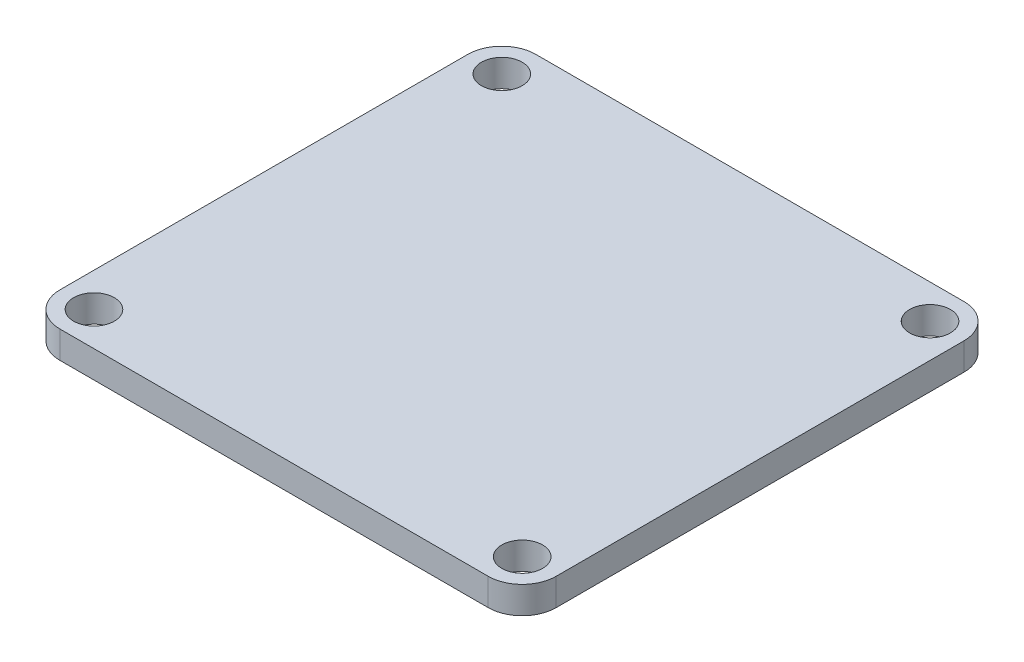
ISO-10303-21;
HEADER;
FILE_DESCRIPTION(('STEP AP214'),'2;1');
FILE_NAME('part.step','',(''),(''),'','','');
FILE_SCHEMA(('AUTOMOTIVE_DESIGN { 1 0 10303 214 1 1 1 1 }'));
ENDSEC;
DATA;
#1=APPLICATION_CONTEXT('core data for automotive mechanical design processes');
#2=APPLICATION_PROTOCOL_DEFINITION('international standard','automotive_design',2000,#1);
#3=PRODUCT_CONTEXT('',#1,'mechanical');
#4=PRODUCT('Part','Part','',(#3));
#5=PRODUCT_RELATED_PRODUCT_CATEGORY('part','',(#4));
#6=PRODUCT_DEFINITION_FORMATION('','',#4);
#7=PRODUCT_DEFINITION_CONTEXT('part definition',#1,'design');
#8=PRODUCT_DEFINITION('design','',#6,#7);
#9=PRODUCT_DEFINITION_SHAPE('','',#8);
#10=(LENGTH_UNIT() NAMED_UNIT(*) SI_UNIT(.MILLI.,.METRE.));
#11=(NAMED_UNIT(*) PLANE_ANGLE_UNIT() SI_UNIT($,.RADIAN.));
#12=(NAMED_UNIT(*) SI_UNIT($,.STERADIAN.) SOLID_ANGLE_UNIT());
#13=UNCERTAINTY_MEASURE_WITH_UNIT(LENGTH_MEASURE(1.E-05),#10,'distance_accuracy_value','');
#14=(GEOMETRIC_REPRESENTATION_CONTEXT(3) GLOBAL_UNCERTAINTY_ASSIGNED_CONTEXT((#13)) GLOBAL_UNIT_ASSIGNED_CONTEXT((#10,
#11,#12)) REPRESENTATION_CONTEXT('',''));
#15=CARTESIAN_POINT('',(0.,0.,0.));
#16=DIRECTION('',(0.,0.,1.));
#17=DIRECTION('',(1.,0.,0.));
#18=AXIS2_PLACEMENT_3D('',#15,#16,#17);
#19=CARTESIAN_POINT('',(-31.5,4.,30.));
#20=DIRECTION('',(0.,-1.,0.));
#21=DIRECTION('',(0.,0.,-1.));
#22=AXIS2_PLACEMENT_3D('',#19,#20,#21);
#23=PLANE('',#22);
#24=CARTESIAN_POINT('',(-31.5,4.,30.));
#25=DIRECTION('',(0.,1.,0.));
#26=DIRECTION('',(0.,0.,-1.));
#27=AXIS2_PLACEMENT_3D('',#24,#25,#26);
#28=CIRCLE('',#27,5.);
#29=CARTESIAN_POINT('',(-36.5,4.,30.));
#30=VERTEX_POINT('',#29);
#31=CARTESIAN_POINT('',(-31.5,4.,35.));
#32=VERTEX_POINT('',#31);
#33=EDGE_CURVE('E147',#30,#32,#28,.T.);
#34=ORIENTED_EDGE('',*,*,#33,.T.);
#35=DIRECTION('',(1.,0.,0.));
#36=VECTOR('',#35,1.);
#37=CARTESIAN_POINT('',(-31.5,4.,35.));
#38=LINE('',#37,#36);
#39=CARTESIAN_POINT('',(31.5,4.,35.));
#40=VERTEX_POINT('',#39);
#41=EDGE_CURVE('E95',#32,#40,#38,.T.);
#42=ORIENTED_EDGE('',*,*,#41,.T.);
#43=CARTESIAN_POINT('',(31.5,4.,30.));
#44=DIRECTION('',(0.,1.,0.));
#45=DIRECTION('',(0.,0.,1.));
#46=AXIS2_PLACEMENT_3D('',#43,#44,#45);
#47=CIRCLE('',#46,5.);
#48=CARTESIAN_POINT('',(36.5,4.,30.));
#49=VERTEX_POINT('',#48);
#50=EDGE_CURVE('E162',#40,#49,#47,.T.);
#51=ORIENTED_EDGE('',*,*,#50,.T.);
#52=DIRECTION('',(0.,0.,-1.));
#53=VECTOR('',#52,1.);
#54=CARTESIAN_POINT('',(36.5,4.,30.));
#55=LINE('',#54,#53);
#56=CARTESIAN_POINT('',(36.5,4.,-30.));
#57=VERTEX_POINT('',#56);
#58=EDGE_CURVE('E175',#49,#57,#55,.T.);
#59=ORIENTED_EDGE('',*,*,#58,.T.);
#60=CARTESIAN_POINT('',(31.5,4.,-30.));
#61=DIRECTION('',(0.,1.,0.));
#62=DIRECTION('',(0.,0.,-1.));
#63=AXIS2_PLACEMENT_3D('',#60,#61,#62);
#64=CIRCLE('',#63,5.);
#65=CARTESIAN_POINT('',(31.5,4.,-35.));
#66=VERTEX_POINT('',#65);
#67=EDGE_CURVE('E114',#57,#66,#64,.T.);
#68=ORIENTED_EDGE('',*,*,#67,.T.);
#69=DIRECTION('',(-1.,0.,0.));
#70=VECTOR('',#69,1.);
#71=CARTESIAN_POINT('',(-31.5,4.,-35.));
#72=LINE('',#71,#70);
#73=CARTESIAN_POINT('',(-31.5,4.,-35.));
#74=VERTEX_POINT('',#73);
#75=EDGE_CURVE('E108',#66,#74,#72,.T.);
#76=ORIENTED_EDGE('',*,*,#75,.T.);
#77=CARTESIAN_POINT('',(-31.5,4.,-30.));
#78=DIRECTION('',(0.,1.,0.));
#79=DIRECTION('',(0.,0.,-1.));
#80=AXIS2_PLACEMENT_3D('',#77,#78,#79);
#81=CIRCLE('',#80,5.);
#82=CARTESIAN_POINT('',(-36.5,4.,-30.));
#83=VERTEX_POINT('',#82);
#84=EDGE_CURVE('E112',#74,#83,#81,.T.);
#85=ORIENTED_EDGE('',*,*,#84,.T.);
#86=DIRECTION('',(0.,0.,1.));
#87=VECTOR('',#86,1.);
#88=CARTESIAN_POINT('',(-36.5,4.,30.));
#89=LINE('',#88,#87);
#90=EDGE_CURVE('E52',#83,#30,#89,.T.);
#91=ORIENTED_EDGE('',*,*,#90,.T.);
#92=EDGE_LOOP('',(#34,#42,#51,#59,#68,#76,#85,#91));
#93=FACE_BOUND('',#92,.T.);
#94=CARTESIAN_POINT('',(-31.5,4.,-30.));
#95=DIRECTION('',(0.,1.,0.));
#96=DIRECTION('',(0.,0.,1.));
#97=AXIS2_PLACEMENT_3D('',#94,#95,#96);
#98=CIRCLE('',#97,3.00000000000001);
#99=CARTESIAN_POINT('',(-31.5,4.,-27.));
#100=VERTEX_POINT('',#99);
#101=EDGE_CURVE('E136',#100,#100,#98,.T.);
#102=ORIENTED_EDGE('',*,*,#101,.F.);
#103=EDGE_LOOP('',(#102));
#104=FACE_BOUND('',#103,.T.);
#105=CARTESIAN_POINT('',(-31.5,4.,30.));
#106=DIRECTION('',(0.,1.,0.));
#107=DIRECTION('',(0.,0.,1.));
#108=AXIS2_PLACEMENT_3D('',#105,#106,#107);
#109=CIRCLE('',#108,3.00000000000001);
#110=CARTESIAN_POINT('',(-31.5,4.,33.));
#111=VERTEX_POINT('',#110);
#112=EDGE_CURVE('E184',#111,#111,#109,.T.);
#113=ORIENTED_EDGE('',*,*,#112,.F.);
#114=EDGE_LOOP('',(#113));
#115=FACE_BOUND('',#114,.T.);
#116=CARTESIAN_POINT('',(31.5,4.,-30.));
#117=DIRECTION('',(0.,1.,0.));
#118=DIRECTION('',(0.,0.,1.));
#119=AXIS2_PLACEMENT_3D('',#116,#117,#118);
#120=CIRCLE('',#119,3.00000000000001);
#121=CARTESIAN_POINT('',(31.5,4.,-27.));
#122=VERTEX_POINT('',#121);
#123=EDGE_CURVE('E190',#122,#122,#120,.T.);
#124=ORIENTED_EDGE('',*,*,#123,.F.);
#125=EDGE_LOOP('',(#124));
#126=FACE_BOUND('',#125,.T.);
#127=CARTESIAN_POINT('',(31.5,4.,30.));
#128=DIRECTION('',(0.,1.,0.));
#129=DIRECTION('',(0.,0.,1.));
#130=AXIS2_PLACEMENT_3D('',#127,#128,#129);
#131=CIRCLE('',#130,3.00000000000001);
#132=CARTESIAN_POINT('',(31.5,4.,33.));
#133=VERTEX_POINT('',#132);
#134=EDGE_CURVE('E196',#133,#133,#131,.T.);
#135=ORIENTED_EDGE('',*,*,#134,.F.);
#136=EDGE_LOOP('',(#135));
#137=FACE_BOUND('',#136,.T.);
#138=ADVANCED_FACE('F35',(#93,#104,#115,#126,#137),#23,.F.);
#139=CARTESIAN_POINT('',(-31.5,0.,30.));
#140=DIRECTION('',(0.,-1.,0.));
#141=DIRECTION('',(0.,0.,-1.));
#142=AXIS2_PLACEMENT_3D('',#139,#140,#141);
#143=PLANE('',#142);
#144=CARTESIAN_POINT('',(31.5,0.,-30.));
#145=DIRECTION('',(0.,1.,0.));
#146=DIRECTION('',(0.,0.,1.));
#147=AXIS2_PLACEMENT_3D('',#144,#145,#146);
#148=CIRCLE('',#147,3.00000000000001);
#149=CARTESIAN_POINT('',(31.5,0.,-27.));
#150=VERTEX_POINT('',#149);
#151=EDGE_CURVE('E193',#150,#150,#148,.T.);
#152=ORIENTED_EDGE('',*,*,#151,.T.);
#153=EDGE_LOOP('',(#152));
#154=FACE_BOUND('',#153,.T.);
#155=CARTESIAN_POINT('',(-31.5,0.,-30.));
#156=DIRECTION('',(0.,1.,0.));
#157=DIRECTION('',(0.,0.,1.));
#158=AXIS2_PLACEMENT_3D('',#155,#156,#157);
#159=CIRCLE('',#158,3.00000000000001);
#160=CARTESIAN_POINT('',(-31.5,0.,-27.));
#161=VERTEX_POINT('',#160);
#162=EDGE_CURVE('E181',#161,#161,#159,.T.);
#163=ORIENTED_EDGE('',*,*,#162,.T.);
#164=EDGE_LOOP('',(#163));
#165=FACE_BOUND('',#164,.T.);
#166=CARTESIAN_POINT('',(-31.5,0.,30.));
#167=DIRECTION('',(0.,1.,0.));
#168=DIRECTION('',(0.,0.,-1.));
#169=AXIS2_PLACEMENT_3D('',#166,#167,#168);
#170=CIRCLE('',#169,5.);
#171=CARTESIAN_POINT('',(-36.5,0.,30.));
#172=VERTEX_POINT('',#171);
#173=CARTESIAN_POINT('',(-31.5,0.,35.));
#174=VERTEX_POINT('',#173);
#175=EDGE_CURVE('E132',#172,#174,#170,.T.);
#176=ORIENTED_EDGE('',*,*,#175,.F.);
#177=DIRECTION('',(0.,0.,1.));
#178=VECTOR('',#177,1.);
#179=CARTESIAN_POINT('',(-36.5,0.,30.));
#180=LINE('',#179,#178);
#181=CARTESIAN_POINT('',(-36.5,0.,-30.));
#182=VERTEX_POINT('',#181);
#183=EDGE_CURVE('E87',#182,#172,#180,.T.);
#184=ORIENTED_EDGE('',*,*,#183,.F.);
#185=CARTESIAN_POINT('',(-31.5,0.,-30.));
#186=DIRECTION('',(0.,1.,0.));
#187=DIRECTION('',(0.,0.,-1.));
#188=AXIS2_PLACEMENT_3D('',#185,#186,#187);
#189=CIRCLE('',#188,5.);
#190=CARTESIAN_POINT('',(-31.5,0.,-35.));
#191=VERTEX_POINT('',#190);
#192=EDGE_CURVE('E81',#191,#182,#189,.T.);
#193=ORIENTED_EDGE('',*,*,#192,.F.);
#194=DIRECTION('',(-1.,0.,0.));
#195=VECTOR('',#194,1.);
#196=CARTESIAN_POINT('',(-31.5,0.,-35.));
#197=LINE('',#196,#195);
#198=CARTESIAN_POINT('',(31.5,0.,-35.));
#199=VERTEX_POINT('',#198);
#200=EDGE_CURVE('E122',#199,#191,#197,.T.);
#201=ORIENTED_EDGE('',*,*,#200,.F.);
#202=CARTESIAN_POINT('',(31.5,0.,-30.));
#203=DIRECTION('',(0.,1.,0.));
#204=DIRECTION('',(0.,0.,-1.));
#205=AXIS2_PLACEMENT_3D('',#202,#203,#204);
#206=CIRCLE('',#205,5.);
#207=CARTESIAN_POINT('',(36.5,0.,-30.));
#208=VERTEX_POINT('',#207);
#209=EDGE_CURVE('E142',#208,#199,#206,.T.);
#210=ORIENTED_EDGE('',*,*,#209,.F.);
#211=DIRECTION('',(0.,0.,-1.));
#212=VECTOR('',#211,1.);
#213=CARTESIAN_POINT('',(36.5,0.,30.));
#214=LINE('',#213,#212);
#215=CARTESIAN_POINT('',(36.5,0.,30.));
#216=VERTEX_POINT('',#215);
#217=EDGE_CURVE('E140',#216,#208,#214,.T.);
#218=ORIENTED_EDGE('',*,*,#217,.F.);
#219=CARTESIAN_POINT('',(31.5,0.,30.));
#220=DIRECTION('',(0.,1.,0.));
#221=DIRECTION('',(0.,0.,1.));
#222=AXIS2_PLACEMENT_3D('',#219,#220,#221);
#223=CIRCLE('',#222,5.);
#224=CARTESIAN_POINT('',(31.5,0.,35.));
#225=VERTEX_POINT('',#224);
#226=EDGE_CURVE('E138',#225,#216,#223,.T.);
#227=ORIENTED_EDGE('',*,*,#226,.F.);
#228=DIRECTION('',(1.,0.,0.));
#229=VECTOR('',#228,1.);
#230=CARTESIAN_POINT('',(-31.5,0.,35.));
#231=LINE('',#230,#229);
#232=EDGE_CURVE('E135',#174,#225,#231,.T.);
#233=ORIENTED_EDGE('',*,*,#232,.F.);
#234=EDGE_LOOP('',(#176,#184,#193,#201,#210,#218,#227,#233));
#235=FACE_BOUND('',#234,.T.);
#236=CARTESIAN_POINT('',(-31.5,0.,30.));
#237=DIRECTION('',(0.,1.,0.));
#238=DIRECTION('',(0.,0.,1.));
#239=AXIS2_PLACEMENT_3D('',#236,#237,#238);
#240=CIRCLE('',#239,3.00000000000001);
#241=CARTESIAN_POINT('',(-31.5,0.,33.));
#242=VERTEX_POINT('',#241);
#243=EDGE_CURVE('E187',#242,#242,#240,.T.);
#244=ORIENTED_EDGE('',*,*,#243,.T.);
#245=EDGE_LOOP('',(#244));
#246=FACE_BOUND('',#245,.T.);
#247=CARTESIAN_POINT('',(31.5,0.,30.));
#248=DIRECTION('',(0.,1.,0.));
#249=DIRECTION('',(0.,0.,1.));
#250=AXIS2_PLACEMENT_3D('',#247,#248,#249);
#251=CIRCLE('',#250,3.00000000000001);
#252=CARTESIAN_POINT('',(31.5,0.,33.));
#253=VERTEX_POINT('',#252);
#254=EDGE_CURVE('E199',#253,#253,#251,.T.);
#255=ORIENTED_EDGE('',*,*,#254,.T.);
#256=EDGE_LOOP('',(#255));
#257=FACE_BOUND('',#256,.T.);
#258=ADVANCED_FACE('F166',(#154,#165,#235,#246,#257),#143,.T.);
#259=CARTESIAN_POINT('',(-31.5,4.,30.));
#260=DIRECTION('',(0.,-1.,0.));
#261=DIRECTION('',(0.,0.,-1.));
#262=AXIS2_PLACEMENT_3D('',#259,#260,#261);
#263=CYLINDRICAL_SURFACE('',#262,5.);
#264=ORIENTED_EDGE('',*,*,#175,.T.);
#265=DIRECTION('',(0.,-1.,0.));
#266=VECTOR('',#265,1.);
#267=CARTESIAN_POINT('',(-31.5,4.,35.));
#268=LINE('',#267,#266);
#269=EDGE_CURVE('E11',#32,#174,#268,.T.);
#270=ORIENTED_EDGE('',*,*,#269,.F.);
#271=ORIENTED_EDGE('',*,*,#33,.F.);
#272=DIRECTION('',(0.,-1.,0.));
#273=VECTOR('',#272,1.);
#274=CARTESIAN_POINT('',(-36.5,4.,30.));
#275=LINE('',#274,#273);
#276=EDGE_CURVE('E128',#30,#172,#275,.T.);
#277=ORIENTED_EDGE('',*,*,#276,.T.);
#278=EDGE_LOOP('',(#264,#270,#271,#277));
#279=FACE_BOUND('',#278,.T.);
#280=ADVANCED_FACE('F37',(#279),#263,.T.);
#281=CARTESIAN_POINT('',(-31.5,4.,35.));
#282=DIRECTION('',(0.,0.,-1.));
#283=DIRECTION('',(-1.,0.,0.));
#284=AXIS2_PLACEMENT_3D('',#281,#282,#283);
#285=PLANE('',#284);
#286=ORIENTED_EDGE('',*,*,#232,.T.);
#287=DIRECTION('',(0.,-1.,0.));
#288=VECTOR('',#287,1.);
#289=CARTESIAN_POINT('',(31.5,4.,35.));
#290=LINE('',#289,#288);
#291=EDGE_CURVE('E44',#40,#225,#290,.T.);
#292=ORIENTED_EDGE('',*,*,#291,.F.);
#293=ORIENTED_EDGE('',*,*,#41,.F.);
#294=ORIENTED_EDGE('',*,*,#269,.T.);
#295=EDGE_LOOP('',(#286,#292,#293,#294));
#296=FACE_BOUND('',#295,.T.);
#297=ADVANCED_FACE('F231',(#296),#285,.F.);
#298=CARTESIAN_POINT('',(31.5,4.,30.));
#299=DIRECTION('',(0.,-1.,0.));
#300=DIRECTION('',(0.,0.,-1.));
#301=AXIS2_PLACEMENT_3D('',#298,#299,#300);
#302=CYLINDRICAL_SURFACE('',#301,5.);
#303=ORIENTED_EDGE('',*,*,#226,.T.);
#304=DIRECTION('',(0.,-1.,0.));
#305=VECTOR('',#304,1.);
#306=CARTESIAN_POINT('',(36.5,4.,30.));
#307=LINE('',#306,#305);
#308=EDGE_CURVE('E154',#49,#216,#307,.T.);
#309=ORIENTED_EDGE('',*,*,#308,.F.);
#310=ORIENTED_EDGE('',*,*,#50,.F.);
#311=ORIENTED_EDGE('',*,*,#291,.T.);
#312=EDGE_LOOP('',(#303,#309,#310,#311));
#313=FACE_BOUND('',#312,.T.);
#314=ADVANCED_FACE('F160',(#313),#302,.T.);
#315=CARTESIAN_POINT('',(36.5,4.,30.));
#316=DIRECTION('',(-1.,0.,0.));
#317=DIRECTION('',(0.,0.,1.));
#318=AXIS2_PLACEMENT_3D('',#315,#316,#317);
#319=PLANE('',#318);
#320=ORIENTED_EDGE('',*,*,#217,.T.);
#321=DIRECTION('',(0.,-1.,0.));
#322=VECTOR('',#321,1.);
#323=CARTESIAN_POINT('',(36.5,4.,-30.));
#324=LINE('',#323,#322);
#325=EDGE_CURVE('E151',#57,#208,#324,.T.);
#326=ORIENTED_EDGE('',*,*,#325,.F.);
#327=ORIENTED_EDGE('',*,*,#58,.F.);
#328=ORIENTED_EDGE('',*,*,#308,.T.);
#329=EDGE_LOOP('',(#320,#326,#327,#328));
#330=FACE_BOUND('',#329,.T.);
#331=ADVANCED_FACE('F171',(#330),#319,.F.);
#332=CARTESIAN_POINT('',(31.5,4.,-30.));
#333=DIRECTION('',(0.,-1.,0.));
#334=DIRECTION('',(0.,0.,-1.));
#335=AXIS2_PLACEMENT_3D('',#332,#333,#334);
#336=CYLINDRICAL_SURFACE('',#335,5.);
#337=ORIENTED_EDGE('',*,*,#209,.T.);
#338=DIRECTION('',(0.,-1.,0.));
#339=VECTOR('',#338,1.);
#340=CARTESIAN_POINT('',(31.5,4.,-35.));
#341=LINE('',#340,#339);
#342=EDGE_CURVE('E123',#66,#199,#341,.T.);
#343=ORIENTED_EDGE('',*,*,#342,.F.);
#344=ORIENTED_EDGE('',*,*,#67,.F.);
#345=ORIENTED_EDGE('',*,*,#325,.T.);
#346=EDGE_LOOP('',(#337,#343,#344,#345));
#347=FACE_BOUND('',#346,.T.);
#348=ADVANCED_FACE('F174',(#347),#336,.T.);
#349=CARTESIAN_POINT('',(-31.5,4.,-35.));
#350=DIRECTION('',(0.,0.,1.));
#351=DIRECTION('',(1.,0.,0.));
#352=AXIS2_PLACEMENT_3D('',#349,#350,#351);
#353=PLANE('',#352);
#354=ORIENTED_EDGE('',*,*,#200,.T.);
#355=DIRECTION('',(0.,-1.,0.));
#356=VECTOR('',#355,1.);
#357=CARTESIAN_POINT('',(-31.5,4.,-35.));
#358=LINE('',#357,#356);
#359=EDGE_CURVE('E119',#74,#191,#358,.T.);
#360=ORIENTED_EDGE('',*,*,#359,.F.);
#361=ORIENTED_EDGE('',*,*,#75,.F.);
#362=ORIENTED_EDGE('',*,*,#342,.T.);
#363=EDGE_LOOP('',(#354,#360,#361,#362));
#364=FACE_BOUND('',#363,.T.);
#365=ADVANCED_FACE('F120',(#364),#353,.F.);
#366=CARTESIAN_POINT('',(-31.5,4.,-30.));
#367=DIRECTION('',(0.,-1.,0.));
#368=DIRECTION('',(0.,0.,-1.));
#369=AXIS2_PLACEMENT_3D('',#366,#367,#368);
#370=CYLINDRICAL_SURFACE('',#369,5.);
#371=ORIENTED_EDGE('',*,*,#192,.T.);
#372=DIRECTION('',(0.,-1.,0.));
#373=VECTOR('',#372,1.);
#374=CARTESIAN_POINT('',(-36.5,4.,-30.));
#375=LINE('',#374,#373);
#376=EDGE_CURVE('E124',#83,#182,#375,.T.);
#377=ORIENTED_EDGE('',*,*,#376,.F.);
#378=ORIENTED_EDGE('',*,*,#84,.F.);
#379=ORIENTED_EDGE('',*,*,#359,.T.);
#380=EDGE_LOOP('',(#371,#377,#378,#379));
#381=FACE_BOUND('',#380,.T.);
#382=ADVANCED_FACE('F126',(#381),#370,.T.);
#383=CARTESIAN_POINT('',(-36.5,4.,30.));
#384=DIRECTION('',(1.,0.,0.));
#385=DIRECTION('',(0.,0.,-1.));
#386=AXIS2_PLACEMENT_3D('',#383,#384,#385);
#387=PLANE('',#386);
#388=ORIENTED_EDGE('',*,*,#183,.T.);
#389=ORIENTED_EDGE('',*,*,#276,.F.);
#390=ORIENTED_EDGE('',*,*,#90,.F.);
#391=ORIENTED_EDGE('',*,*,#376,.T.);
#392=EDGE_LOOP('',(#388,#389,#390,#391));
#393=FACE_BOUND('',#392,.T.);
#394=ADVANCED_FACE('F219',(#393),#387,.F.);
#395=CARTESIAN_POINT('',(-31.5,4.,-30.));
#396=DIRECTION('',(0.,-1.,0.));
#397=DIRECTION('',(0.,0.,-1.));
#398=AXIS2_PLACEMENT_3D('',#395,#396,#397);
#399=CYLINDRICAL_SURFACE('',#398,3.00000000000001);
#400=ORIENTED_EDGE('',*,*,#101,.T.);
#401=EDGE_LOOP('',(#400));
#402=FACE_BOUND('',#401,.T.);
#403=ORIENTED_EDGE('',*,*,#162,.F.);
#404=EDGE_LOOP('',(#403));
#405=FACE_BOUND('',#404,.T.);
#406=ADVANCED_FACE('F216',(#402,#405),#399,.F.);
#407=CARTESIAN_POINT('',(-31.5,4.,30.));
#408=DIRECTION('',(0.,-1.,0.));
#409=DIRECTION('',(0.,0.,-1.));
#410=AXIS2_PLACEMENT_3D('',#407,#408,#409);
#411=CYLINDRICAL_SURFACE('',#410,3.00000000000001);
#412=ORIENTED_EDGE('',*,*,#112,.T.);
#413=EDGE_LOOP('',(#412));
#414=FACE_BOUND('',#413,.T.);
#415=ORIENTED_EDGE('',*,*,#243,.F.);
#416=EDGE_LOOP('',(#415));
#417=FACE_BOUND('',#416,.T.);
#418=ADVANCED_FACE('F295',(#414,#417),#411,.F.);
#419=CARTESIAN_POINT('',(31.5,4.,-30.));
#420=DIRECTION('',(0.,-1.,0.));
#421=DIRECTION('',(0.,0.,-1.));
#422=AXIS2_PLACEMENT_3D('',#419,#420,#421);
#423=CYLINDRICAL_SURFACE('',#422,3.00000000000001);
#424=ORIENTED_EDGE('',*,*,#123,.T.);
#425=EDGE_LOOP('',(#424));
#426=FACE_BOUND('',#425,.T.);
#427=ORIENTED_EDGE('',*,*,#151,.F.);
#428=EDGE_LOOP('',(#427));
#429=FACE_BOUND('',#428,.T.);
#430=ADVANCED_FACE('F303',(#426,#429),#423,.F.);
#431=CARTESIAN_POINT('',(31.5,4.,30.));
#432=DIRECTION('',(0.,-1.,0.));
#433=DIRECTION('',(0.,0.,-1.));
#434=AXIS2_PLACEMENT_3D('',#431,#432,#433);
#435=CYLINDRICAL_SURFACE('',#434,3.00000000000001);
#436=ORIENTED_EDGE('',*,*,#134,.T.);
#437=EDGE_LOOP('',(#436));
#438=FACE_BOUND('',#437,.T.);
#439=ORIENTED_EDGE('',*,*,#254,.F.);
#440=EDGE_LOOP('',(#439));
#441=FACE_BOUND('',#440,.T.);
#442=ADVANCED_FACE('F205',(#438,#441),#435,.F.);
#443=CLOSED_SHELL('',(#138,#258,#280,#297,#314,#331,#348,#365,#382,#394,#406,#418,#430,#442));
#444=MANIFOLD_SOLID_BREP('B2',#443);
#445=ADVANCED_BREP_SHAPE_REPRESENTATION('',(#18,#444),#14);
#446=SHAPE_DEFINITION_REPRESENTATION(#9,#445);
ENDSEC;
END-ISO-10303-21;
